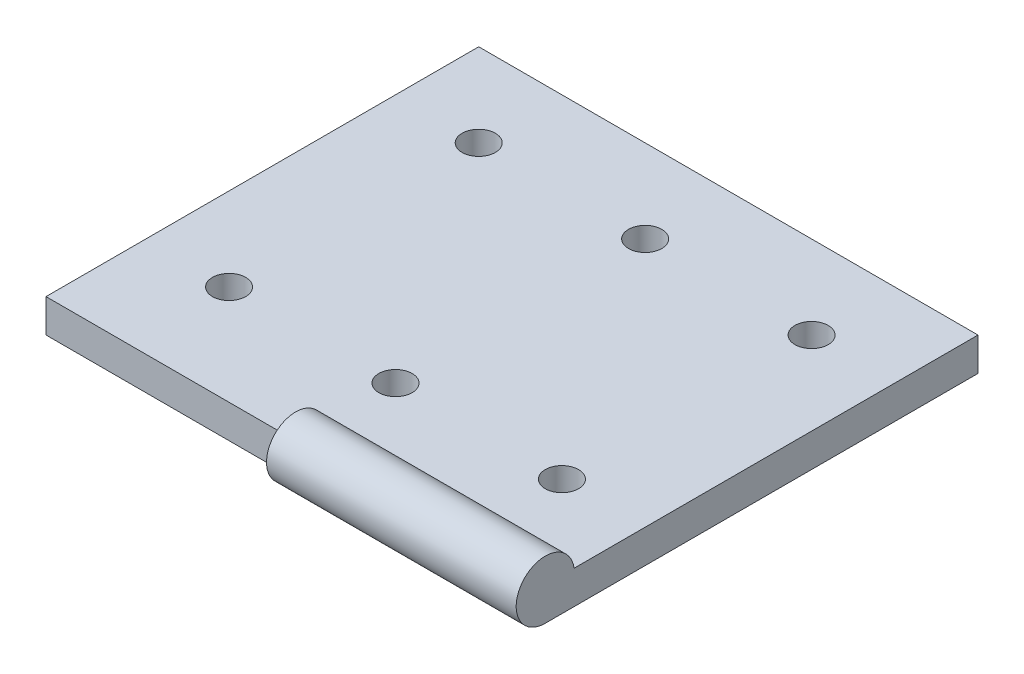
ISO-10303-21;
HEADER;
FILE_DESCRIPTION(('STEP AP214'),'2;1');
FILE_NAME('part.step','',(''),(''),'','','');
FILE_SCHEMA(('AUTOMOTIVE_DESIGN { 1 0 10303 214 1 1 1 1 }'));
ENDSEC;
DATA;
#1=APPLICATION_CONTEXT('core data for automotive mechanical design processes');
#2=APPLICATION_PROTOCOL_DEFINITION('international standard','automotive_design',2000,#1);
#3=PRODUCT_CONTEXT('',#1,'mechanical');
#4=PRODUCT('Part','Part','',(#3));
#5=PRODUCT_RELATED_PRODUCT_CATEGORY('part','',(#4));
#6=PRODUCT_DEFINITION_FORMATION('','',#4);
#7=PRODUCT_DEFINITION_CONTEXT('part definition',#1,'design');
#8=PRODUCT_DEFINITION('design','',#6,#7);
#9=PRODUCT_DEFINITION_SHAPE('','',#8);
#10=(LENGTH_UNIT() NAMED_UNIT(*) SI_UNIT(.MILLI.,.METRE.));
#11=(NAMED_UNIT(*) PLANE_ANGLE_UNIT() SI_UNIT($,.RADIAN.));
#12=(NAMED_UNIT(*) SI_UNIT($,.STERADIAN.) SOLID_ANGLE_UNIT());
#13=UNCERTAINTY_MEASURE_WITH_UNIT(LENGTH_MEASURE(1.E-05),#10,'distance_accuracy_value','');
#14=(GEOMETRIC_REPRESENTATION_CONTEXT(3) GLOBAL_UNCERTAINTY_ASSIGNED_CONTEXT((#13)) GLOBAL_UNIT_ASSIGNED_CONTEXT((#10,
#11,#12)) REPRESENTATION_CONTEXT('',''));
#15=CARTESIAN_POINT('',(0.,0.,0.));
#16=DIRECTION('',(0.,0.,1.));
#17=DIRECTION('',(1.,0.,0.));
#18=AXIS2_PLACEMENT_3D('',#15,#16,#17);
#19=CARTESIAN_POINT('',(18.0696318410112,1.,173.043414439873));
#20=DIRECTION('',(0.,0.,-1.));
#21=DIRECTION('',(-1.,0.,0.));
#22=AXIS2_PLACEMENT_3D('',#19,#20,#21);
#23=PLANE('',#22);
#24=DIRECTION('',(0.,-1.,0.));
#25=VECTOR('',#24,1.);
#26=CARTESIAN_POINT('',(10.5696318410112,1.,173.043414439873));
#27=LINE('',#26,#25);
#28=CARTESIAN_POINT('',(10.5696318410112,1.,173.043414439873));
#29=VERTEX_POINT('',#28);
#30=CARTESIAN_POINT('',(10.5696318410112,0.,173.043414439873));
#31=VERTEX_POINT('',#30);
#32=EDGE_CURVE('E58',#29,#31,#27,.T.);
#33=ORIENTED_EDGE('',*,*,#32,.F.);
#34=DIRECTION('',(1.,0.,0.));
#35=VECTOR('',#34,1.);
#36=CARTESIAN_POINT('',(18.0696318410112,1.,173.043414439873));
#37=LINE('',#36,#35);
#38=CARTESIAN_POINT('',(3.06963184101119,1.,173.043414439873));
#39=VERTEX_POINT('',#38);
#40=EDGE_CURVE('E126',#39,#29,#37,.T.);
#41=ORIENTED_EDGE('',*,*,#40,.F.);
#42=DIRECTION('',(0.,-1.,0.));
#43=VECTOR('',#42,1.);
#44=CARTESIAN_POINT('',(3.06963184101119,1.,173.043414439873));
#45=LINE('',#44,#43);
#46=CARTESIAN_POINT('',(3.06963184101119,0.,173.043414439873));
#47=VERTEX_POINT('',#46);
#48=EDGE_CURVE('E127',#39,#47,#45,.T.);
#49=ORIENTED_EDGE('',*,*,#48,.T.);
#50=DIRECTION('',(1.,0.,0.));
#51=VECTOR('',#50,1.);
#52=CARTESIAN_POINT('',(18.0696318410112,0.,173.043414439873));
#53=LINE('',#52,#51);
#54=EDGE_CURVE('E105',#47,#31,#53,.T.);
#55=ORIENTED_EDGE('',*,*,#54,.T.);
#56=EDGE_LOOP('',(#33,#41,#49,#55));
#57=FACE_BOUND('',#56,.T.);
#58=ADVANCED_FACE('F35',(#57),#23,.F.);
#59=CARTESIAN_POINT('',(18.0696318410112,1.,160.043414439873));
#60=DIRECTION('',(-1.,0.,0.));
#61=DIRECTION('',(0.,0.,1.));
#62=AXIS2_PLACEMENT_3D('',#59,#60,#61);
#63=PLANE('',#62);
#64=DIRECTION('',(0.,0.,-1.));
#65=VECTOR('',#64,1.);
#66=CARTESIAN_POINT('',(18.0696318410112,1.,160.043414439873));
#67=LINE('',#66,#65);
#68=CARTESIAN_POINT('',(18.0696318410112,1.,172.177389036088));
#69=VERTEX_POINT('',#68);
#70=CARTESIAN_POINT('',(18.0696318410112,1.,160.043414439873));
#71=VERTEX_POINT('',#70);
#72=EDGE_CURVE('E109',#69,#71,#67,.T.);
#73=ORIENTED_EDGE('',*,*,#72,.F.);
#74=CARTESIAN_POINT('',(18.0696318410112,0.875,173.043414439873));
#75=DIRECTION('',(1.,0.,0.));
#76=DIRECTION('',(0.,0.,-1.));
#77=AXIS2_PLACEMENT_3D('',#74,#75,#76);
#78=CIRCLE('',#77,0.874999999999991);
#79=CARTESIAN_POINT('',(18.0696318410112,0.,173.043414439873));
#80=VERTEX_POINT('',#79);
#81=EDGE_CURVE('E102',#69,#80,#78,.T.);
#82=ORIENTED_EDGE('',*,*,#81,.T.);
#83=DIRECTION('',(0.,0.,-1.));
#84=VECTOR('',#83,1.);
#85=CARTESIAN_POINT('',(18.0696318410112,0.,160.043414439873));
#86=LINE('',#85,#84);
#87=CARTESIAN_POINT('',(18.0696318410112,0.,160.043414439873));
#88=VERTEX_POINT('',#87);
#89=EDGE_CURVE('E86',#80,#88,#86,.T.);
#90=ORIENTED_EDGE('',*,*,#89,.T.);
#91=DIRECTION('',(0.,-1.,0.));
#92=VECTOR('',#91,1.);
#93=CARTESIAN_POINT('',(18.0696318410112,1.,160.043414439873));
#94=LINE('',#93,#92);
#95=EDGE_CURVE('E11',#71,#88,#94,.T.);
#96=ORIENTED_EDGE('',*,*,#95,.F.);
#97=EDGE_LOOP('',(#73,#82,#90,#96));
#98=FACE_BOUND('',#97,.T.);
#99=ADVANCED_FACE('F37',(#98),#63,.F.);
#100=CARTESIAN_POINT('',(18.0696318410112,1.,160.043414439873));
#101=DIRECTION('',(0.,0.,1.));
#102=DIRECTION('',(1.,0.,0.));
#103=AXIS2_PLACEMENT_3D('',#100,#101,#102);
#104=PLANE('',#103);
#105=DIRECTION('',(-1.,0.,0.));
#106=VECTOR('',#105,1.);
#107=CARTESIAN_POINT('',(18.0696318410112,0.,160.043414439873));
#108=LINE('',#107,#106);
#109=CARTESIAN_POINT('',(3.06963184101119,0.,160.043414439873));
#110=VERTEX_POINT('',#109);
#111=EDGE_CURVE('E92',#88,#110,#108,.T.);
#112=ORIENTED_EDGE('',*,*,#111,.T.);
#113=DIRECTION('',(0.,-1.,0.));
#114=VECTOR('',#113,1.);
#115=CARTESIAN_POINT('',(3.06963184101119,1.,160.043414439873));
#116=LINE('',#115,#114);
#117=CARTESIAN_POINT('',(3.06963184101119,1.,160.043414439873));
#118=VERTEX_POINT('',#117);
#119=EDGE_CURVE('E43',#118,#110,#116,.T.);
#120=ORIENTED_EDGE('',*,*,#119,.F.);
#121=DIRECTION('',(-1.,0.,0.));
#122=VECTOR('',#121,1.);
#123=CARTESIAN_POINT('',(18.0696318410112,1.,160.043414439873));
#124=LINE('',#123,#122);
#125=EDGE_CURVE('E122',#71,#118,#124,.T.);
#126=ORIENTED_EDGE('',*,*,#125,.F.);
#127=ORIENTED_EDGE('',*,*,#95,.T.);
#128=EDGE_LOOP('',(#112,#120,#126,#127));
#129=FACE_BOUND('',#128,.T.);
#130=ADVANCED_FACE('F158',(#129),#104,.F.);
#131=CARTESIAN_POINT('',(3.06963184101119,1.,160.043414439873));
#132=DIRECTION('',(1.,0.,0.));
#133=DIRECTION('',(0.,0.,-1.));
#134=AXIS2_PLACEMENT_3D('',#131,#132,#133);
#135=PLANE('',#134);
#136=DIRECTION('',(0.,0.,1.));
#137=VECTOR('',#136,1.);
#138=CARTESIAN_POINT('',(3.06963184101119,0.,160.043414439873));
#139=LINE('',#138,#137);
#140=EDGE_CURVE('E106',#110,#47,#139,.T.);
#141=ORIENTED_EDGE('',*,*,#140,.T.);
#142=ORIENTED_EDGE('',*,*,#48,.F.);
#143=DIRECTION('',(0.,0.,1.));
#144=VECTOR('',#143,1.);
#145=CARTESIAN_POINT('',(3.06963184101119,1.,160.043414439873));
#146=LINE('',#145,#144);
#147=EDGE_CURVE('E124',#118,#39,#146,.T.);
#148=ORIENTED_EDGE('',*,*,#147,.F.);
#149=ORIENTED_EDGE('',*,*,#119,.T.);
#150=EDGE_LOOP('',(#141,#142,#148,#149));
#151=FACE_BOUND('',#150,.T.);
#152=ADVANCED_FACE('F136',(#151),#135,.F.);
#153=CARTESIAN_POINT('',(0.,1.,0.));
#154=DIRECTION('',(0.,-1.,0.));
#155=DIRECTION('',(0.,0.,-1.));
#156=AXIS2_PLACEMENT_3D('',#153,#154,#155);
#157=PLANE('',#156);
#158=CARTESIAN_POINT('',(5.56963184101119,1.,162.543414439873));
#159=DIRECTION('',(0.,1.,0.));
#160=DIRECTION('',(0.,0.,1.));
#161=AXIS2_PLACEMENT_3D('',#158,#159,#160);
#162=CIRCLE('',#161,0.500000000000001);
#163=CARTESIAN_POINT('',(5.56963184101119,1.,163.043414439873));
#164=VERTEX_POINT('',#163);
#165=EDGE_CURVE('E176',#164,#164,#162,.T.);
#166=ORIENTED_EDGE('',*,*,#165,.F.);
#167=EDGE_LOOP('',(#166));
#168=FACE_BOUND('',#167,.T.);
#169=CARTESIAN_POINT('',(10.5696318410112,1.,170.043414439873));
#170=DIRECTION('',(0.,1.,0.));
#171=DIRECTION('',(0.,0.,1.));
#172=AXIS2_PLACEMENT_3D('',#169,#170,#171);
#173=CIRCLE('',#172,0.500000000000001);
#174=CARTESIAN_POINT('',(10.5696318410112,1.,170.543414439873));
#175=VERTEX_POINT('',#174);
#176=EDGE_CURVE('E180',#175,#175,#173,.T.);
#177=ORIENTED_EDGE('',*,*,#176,.F.);
#178=EDGE_LOOP('',(#177));
#179=FACE_BOUND('',#178,.T.);
#180=CARTESIAN_POINT('',(10.5696318410112,1.,162.543414439873));
#181=DIRECTION('',(0.,1.,0.));
#182=DIRECTION('',(0.,0.,1.));
#183=AXIS2_PLACEMENT_3D('',#180,#181,#182);
#184=CIRCLE('',#183,0.500000000000001);
#185=CARTESIAN_POINT('',(10.5696318410112,1.,163.043414439873));
#186=VERTEX_POINT('',#185);
#187=EDGE_CURVE('E184',#186,#186,#184,.T.);
#188=ORIENTED_EDGE('',*,*,#187,.F.);
#189=EDGE_LOOP('',(#188));
#190=FACE_BOUND('',#189,.T.);
#191=CARTESIAN_POINT('',(15.5696318410112,1.,170.043414439873));
#192=DIRECTION('',(0.,1.,0.));
#193=DIRECTION('',(0.,0.,1.));
#194=AXIS2_PLACEMENT_3D('',#191,#192,#193);
#195=CIRCLE('',#194,0.499999999999998);
#196=CARTESIAN_POINT('',(15.5696318410112,1.,170.543414439873));
#197=VERTEX_POINT('',#196);
#198=EDGE_CURVE('E188',#197,#197,#195,.T.);
#199=ORIENTED_EDGE('',*,*,#198,.F.);
#200=EDGE_LOOP('',(#199));
#201=FACE_BOUND('',#200,.T.);
#202=CARTESIAN_POINT('',(5.56963184101119,1.,170.043414439873));
#203=DIRECTION('',(0.,1.,0.));
#204=DIRECTION('',(0.,0.,1.));
#205=AXIS2_PLACEMENT_3D('',#202,#203,#204);
#206=CIRCLE('',#205,0.500000000000001);
#207=CARTESIAN_POINT('',(5.56963184101119,1.,170.543414439873));
#208=VERTEX_POINT('',#207);
#209=EDGE_CURVE('E192',#208,#208,#206,.T.);
#210=ORIENTED_EDGE('',*,*,#209,.F.);
#211=EDGE_LOOP('',(#210));
#212=FACE_BOUND('',#211,.T.);
#213=CARTESIAN_POINT('',(15.5696318410112,1.,162.543414439873));
#214=DIRECTION('',(0.,1.,0.));
#215=DIRECTION('',(0.,0.,1.));
#216=AXIS2_PLACEMENT_3D('',#213,#214,#215);
#217=CIRCLE('',#216,0.499999999999998);
#218=CARTESIAN_POINT('',(15.5696318410112,1.,163.043414439873));
#219=VERTEX_POINT('',#218);
#220=EDGE_CURVE('E114',#219,#219,#217,.T.);
#221=ORIENTED_EDGE('',*,*,#220,.F.);
#222=EDGE_LOOP('',(#221));
#223=FACE_BOUND('',#222,.T.);
#224=DIRECTION('',(0.,0.,1.));
#225=VECTOR('',#224,1.);
#226=CARTESIAN_POINT('',(10.5696318410112,1.,0.));
#227=LINE('',#226,#225);
#228=CARTESIAN_POINT('',(10.5696318410112,1.,172.177389036088));
#229=VERTEX_POINT('',#228);
#230=EDGE_CURVE('E50',#229,#29,#227,.T.);
#231=ORIENTED_EDGE('',*,*,#230,.F.);
#232=DIRECTION('',(1.,0.,0.));
#233=VECTOR('',#232,1.);
#234=CARTESIAN_POINT('',(10.5696318410112,1.,172.177389036088));
#235=LINE('',#234,#233);
#236=EDGE_CURVE('E96',#229,#69,#235,.T.);
#237=ORIENTED_EDGE('',*,*,#236,.T.);
#238=ORIENTED_EDGE('',*,*,#72,.T.);
#239=ORIENTED_EDGE('',*,*,#125,.T.);
#240=ORIENTED_EDGE('',*,*,#147,.T.);
#241=ORIENTED_EDGE('',*,*,#40,.T.);
#242=EDGE_LOOP('',(#231,#237,#238,#239,#240,#241));
#243=FACE_BOUND('',#242,.T.);
#244=ADVANCED_FACE('F163',(#168,#179,#190,#201,#212,#223,#243),#157,.F.);
#245=CARTESIAN_POINT('',(0.,0.,0.));
#246=DIRECTION('',(0.,-1.,0.));
#247=DIRECTION('',(0.,0.,-1.));
#248=AXIS2_PLACEMENT_3D('',#245,#246,#247);
#249=PLANE('',#248);
#250=CARTESIAN_POINT('',(5.56963184101119,0.,162.543414439873));
#251=DIRECTION('',(0.,1.,0.));
#252=DIRECTION('',(0.,0.,1.));
#253=AXIS2_PLACEMENT_3D('',#250,#251,#252);
#254=CIRCLE('',#253,0.500000000000001);
#255=CARTESIAN_POINT('',(5.56963184101119,0.,163.043414439873));
#256=VERTEX_POINT('',#255);
#257=EDGE_CURVE('E207',#256,#256,#254,.T.);
#258=ORIENTED_EDGE('',*,*,#257,.T.);
#259=EDGE_LOOP('',(#258));
#260=FACE_BOUND('',#259,.T.);
#261=CARTESIAN_POINT('',(10.5696318410112,0.,170.043414439873));
#262=DIRECTION('',(0.,1.,0.));
#263=DIRECTION('',(0.,0.,1.));
#264=AXIS2_PLACEMENT_3D('',#261,#262,#263);
#265=CIRCLE('',#264,0.500000000000001);
#266=CARTESIAN_POINT('',(10.5696318410112,0.,170.543414439873));
#267=VERTEX_POINT('',#266);
#268=EDGE_CURVE('E202',#267,#267,#265,.T.);
#269=ORIENTED_EDGE('',*,*,#268,.T.);
#270=EDGE_LOOP('',(#269));
#271=FACE_BOUND('',#270,.T.);
#272=CARTESIAN_POINT('',(10.5696318410112,0.,162.543414439873));
#273=DIRECTION('',(0.,1.,0.));
#274=DIRECTION('',(0.,0.,1.));
#275=AXIS2_PLACEMENT_3D('',#272,#273,#274);
#276=CIRCLE('',#275,0.500000000000001);
#277=CARTESIAN_POINT('',(10.5696318410112,0.,163.043414439873));
#278=VERTEX_POINT('',#277);
#279=EDGE_CURVE('E201',#278,#278,#276,.T.);
#280=ORIENTED_EDGE('',*,*,#279,.T.);
#281=EDGE_LOOP('',(#280));
#282=FACE_BOUND('',#281,.T.);
#283=CARTESIAN_POINT('',(15.5696318410112,0.,170.043414439873));
#284=DIRECTION('',(0.,1.,0.));
#285=DIRECTION('',(0.,0.,1.));
#286=AXIS2_PLACEMENT_3D('',#283,#284,#285);
#287=CIRCLE('',#286,0.499999999999998);
#288=CARTESIAN_POINT('',(15.5696318410112,0.,170.543414439873));
#289=VERTEX_POINT('',#288);
#290=EDGE_CURVE('E196',#289,#289,#287,.T.);
#291=ORIENTED_EDGE('',*,*,#290,.T.);
#292=EDGE_LOOP('',(#291));
#293=FACE_BOUND('',#292,.T.);
#294=CARTESIAN_POINT('',(5.56963184101119,0.,170.043414439873));
#295=DIRECTION('',(0.,1.,0.));
#296=DIRECTION('',(0.,0.,1.));
#297=AXIS2_PLACEMENT_3D('',#294,#295,#296);
#298=CIRCLE('',#297,0.500000000000001);
#299=CARTESIAN_POINT('',(5.56963184101119,0.,170.543414439873));
#300=VERTEX_POINT('',#299);
#301=EDGE_CURVE('E208',#300,#300,#298,.T.);
#302=ORIENTED_EDGE('',*,*,#301,.T.);
#303=EDGE_LOOP('',(#302));
#304=FACE_BOUND('',#303,.T.);
#305=CARTESIAN_POINT('',(15.5696318410112,0.,162.543414439873));
#306=DIRECTION('',(0.,1.,0.));
#307=DIRECTION('',(0.,0.,1.));
#308=AXIS2_PLACEMENT_3D('',#305,#306,#307);
#309=CIRCLE('',#308,0.499999999999998);
#310=CARTESIAN_POINT('',(15.5696318410112,0.,163.043414439873));
#311=VERTEX_POINT('',#310);
#312=EDGE_CURVE('E110',#311,#311,#309,.T.);
#313=ORIENTED_EDGE('',*,*,#312,.T.);
#314=EDGE_LOOP('',(#313));
#315=FACE_BOUND('',#314,.T.);
#316=ORIENTED_EDGE('',*,*,#89,.F.);
#317=EDGE_CURVE('E90',#31,#80,#53,.T.);
#318=ORIENTED_EDGE('',*,*,#317,.F.);
#319=ORIENTED_EDGE('',*,*,#54,.F.);
#320=ORIENTED_EDGE('',*,*,#140,.F.);
#321=ORIENTED_EDGE('',*,*,#111,.F.);
#322=EDGE_LOOP('',(#316,#318,#319,#320,#321));
#323=FACE_BOUND('',#322,.T.);
#324=ADVANCED_FACE('F88',(#260,#271,#282,#293,#304,#315,#323),#249,.T.);
#325=CARTESIAN_POINT('',(10.5696318410112,0.875,173.043414439873));
#326=DIRECTION('',(1.,0.,0.));
#327=DIRECTION('',(0.,0.,-1.));
#328=AXIS2_PLACEMENT_3D('',#325,#326,#327);
#329=CYLINDRICAL_SURFACE('',#328,0.874999999999991);
#330=ORIENTED_EDGE('',*,*,#236,.F.);
#331=CARTESIAN_POINT('',(10.5696318410112,0.875,173.043414439873));
#332=DIRECTION('',(1.,0.,0.));
#333=DIRECTION('',(0.,0.,-1.));
#334=AXIS2_PLACEMENT_3D('',#331,#332,#333);
#335=CIRCLE('',#334,0.874999999999991);
#336=EDGE_CURVE('E104',#229,#31,#335,.T.);
#337=ORIENTED_EDGE('',*,*,#336,.T.);
#338=ORIENTED_EDGE('',*,*,#317,.T.);
#339=ORIENTED_EDGE('',*,*,#81,.F.);
#340=EDGE_LOOP('',(#330,#337,#338,#339));
#341=FACE_BOUND('',#340,.T.);
#342=ADVANCED_FACE('F101',(#341),#329,.T.);
#343=CARTESIAN_POINT('',(10.5696318410112,0.875,173.043414439873));
#344=DIRECTION('',(1.,0.,0.));
#345=DIRECTION('',(0.,0.,-1.));
#346=AXIS2_PLACEMENT_3D('',#343,#344,#345);
#347=PLANE('',#346);
#348=ORIENTED_EDGE('',*,*,#230,.T.);
#349=ORIENTED_EDGE('',*,*,#32,.T.);
#350=ORIENTED_EDGE('',*,*,#336,.F.);
#351=EDGE_LOOP('',(#348,#349,#350));
#352=FACE_BOUND('',#351,.T.);
#353=ADVANCED_FACE('F141',(#352),#347,.F.);
#354=CARTESIAN_POINT('',(15.5696318410112,0.,162.543414439873));
#355=DIRECTION('',(0.,1.,0.));
#356=DIRECTION('',(0.,0.,1.));
#357=AXIS2_PLACEMENT_3D('',#354,#355,#356);
#358=CYLINDRICAL_SURFACE('',#357,0.499999999999998);
#359=ORIENTED_EDGE('',*,*,#312,.F.);
#360=EDGE_LOOP('',(#359));
#361=FACE_BOUND('',#360,.T.);
#362=ORIENTED_EDGE('',*,*,#220,.T.);
#363=EDGE_LOOP('',(#362));
#364=FACE_BOUND('',#363,.T.);
#365=ADVANCED_FACE('F143',(#361,#364),#358,.F.);
#366=CARTESIAN_POINT('',(5.56963184101119,0.,170.043414439873));
#367=DIRECTION('',(0.,1.,0.));
#368=DIRECTION('',(0.,0.,1.));
#369=AXIS2_PLACEMENT_3D('',#366,#367,#368);
#370=CYLINDRICAL_SURFACE('',#369,0.500000000000001);
#371=ORIENTED_EDGE('',*,*,#301,.F.);
#372=EDGE_LOOP('',(#371));
#373=FACE_BOUND('',#372,.T.);
#374=ORIENTED_EDGE('',*,*,#209,.T.);
#375=EDGE_LOOP('',(#374));
#376=FACE_BOUND('',#375,.T.);
#377=ADVANCED_FACE('F149',(#373,#376),#370,.F.);
#378=CARTESIAN_POINT('',(15.5696318410112,0.,170.043414439873));
#379=DIRECTION('',(0.,1.,0.));
#380=DIRECTION('',(0.,0.,1.));
#381=AXIS2_PLACEMENT_3D('',#378,#379,#380);
#382=CYLINDRICAL_SURFACE('',#381,0.499999999999998);
#383=ORIENTED_EDGE('',*,*,#290,.F.);
#384=EDGE_LOOP('',(#383));
#385=FACE_BOUND('',#384,.T.);
#386=ORIENTED_EDGE('',*,*,#198,.T.);
#387=EDGE_LOOP('',(#386));
#388=FACE_BOUND('',#387,.T.);
#389=ADVANCED_FACE('F222',(#385,#388),#382,.F.);
#390=CARTESIAN_POINT('',(10.5696318410112,0.,162.543414439873));
#391=DIRECTION('',(0.,1.,0.));
#392=DIRECTION('',(0.,0.,1.));
#393=AXIS2_PLACEMENT_3D('',#390,#391,#392);
#394=CYLINDRICAL_SURFACE('',#393,0.500000000000001);
#395=ORIENTED_EDGE('',*,*,#279,.F.);
#396=EDGE_LOOP('',(#395));
#397=FACE_BOUND('',#396,.T.);
#398=ORIENTED_EDGE('',*,*,#187,.T.);
#399=EDGE_LOOP('',(#398));
#400=FACE_BOUND('',#399,.T.);
#401=ADVANCED_FACE('F227',(#397,#400),#394,.F.);
#402=CARTESIAN_POINT('',(10.5696318410112,0.,170.043414439873));
#403=DIRECTION('',(0.,1.,0.));
#404=DIRECTION('',(0.,0.,1.));
#405=AXIS2_PLACEMENT_3D('',#402,#403,#404);
#406=CYLINDRICAL_SURFACE('',#405,0.500000000000001);
#407=ORIENTED_EDGE('',*,*,#268,.F.);
#408=EDGE_LOOP('',(#407));
#409=FACE_BOUND('',#408,.T.);
#410=ORIENTED_EDGE('',*,*,#176,.T.);
#411=EDGE_LOOP('',(#410));
#412=FACE_BOUND('',#411,.T.);
#413=ADVANCED_FACE('F231',(#409,#412),#406,.F.);
#414=CARTESIAN_POINT('',(5.56963184101119,0.,162.543414439873));
#415=DIRECTION('',(0.,1.,0.));
#416=DIRECTION('',(0.,0.,1.));
#417=AXIS2_PLACEMENT_3D('',#414,#415,#416);
#418=CYLINDRICAL_SURFACE('',#417,0.500000000000001);
#419=ORIENTED_EDGE('',*,*,#257,.F.);
#420=EDGE_LOOP('',(#419));
#421=FACE_BOUND('',#420,.T.);
#422=ORIENTED_EDGE('',*,*,#165,.T.);
#423=EDGE_LOOP('',(#422));
#424=FACE_BOUND('',#423,.T.);
#425=ADVANCED_FACE('F234',(#421,#424),#418,.F.);
#426=CLOSED_SHELL('',(#58,#99,#130,#152,#244,#324,#342,#353,#365,#377,#389,#401,#413,#425));
#427=MANIFOLD_SOLID_BREP('B2',#426);
#428=ADVANCED_BREP_SHAPE_REPRESENTATION('',(#18,#427),#14);
#429=SHAPE_DEFINITION_REPRESENTATION(#9,#428);
ENDSEC;
END-ISO-10303-21;
